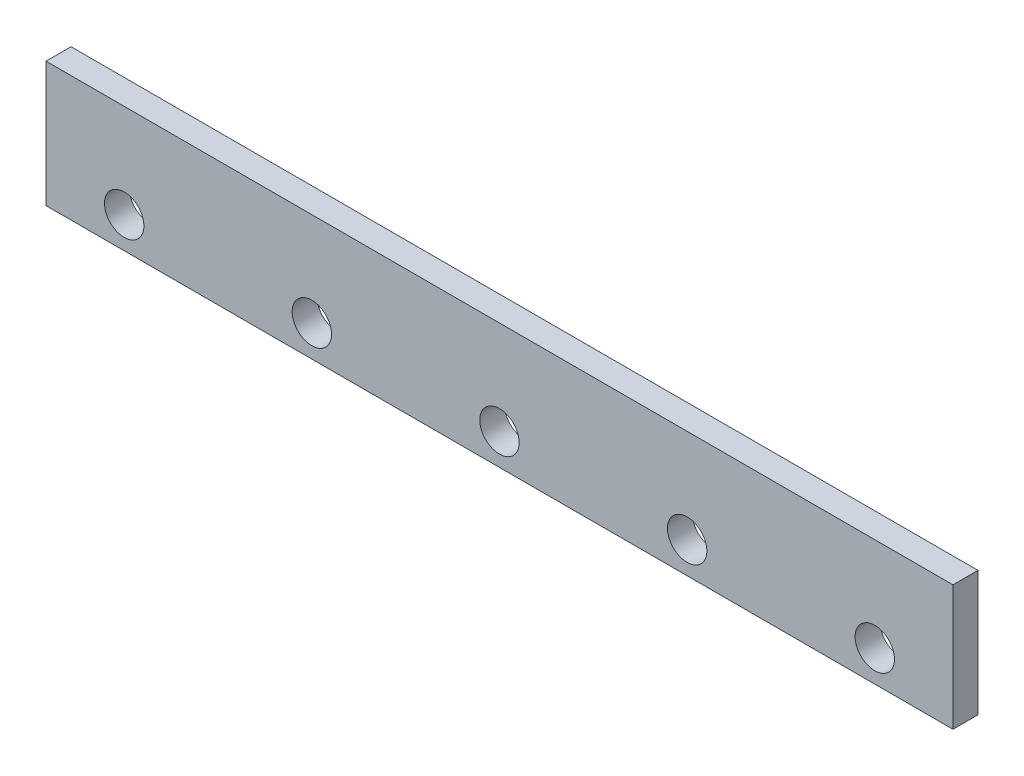
ISO-10303-21;
HEADER;
FILE_DESCRIPTION(('STEP AP214'),'2;1');
FILE_NAME('part.step','',(''),(''),'','','');
FILE_SCHEMA(('AUTOMOTIVE_DESIGN { 1 0 10303 214 1 1 1 1 }'));
ENDSEC;
DATA;
#1=APPLICATION_CONTEXT('core data for automotive mechanical design processes');
#2=APPLICATION_PROTOCOL_DEFINITION('international standard','automotive_design',2000,#1);
#3=PRODUCT_CONTEXT('',#1,'mechanical');
#4=PRODUCT('Part','Part','',(#3));
#5=PRODUCT_RELATED_PRODUCT_CATEGORY('part','',(#4));
#6=PRODUCT_DEFINITION_FORMATION('','',#4);
#7=PRODUCT_DEFINITION_CONTEXT('part definition',#1,'design');
#8=PRODUCT_DEFINITION('design','',#6,#7);
#9=PRODUCT_DEFINITION_SHAPE('','',#8);
#10=(LENGTH_UNIT() NAMED_UNIT(*) SI_UNIT(.MILLI.,.METRE.));
#11=(NAMED_UNIT(*) PLANE_ANGLE_UNIT() SI_UNIT($,.RADIAN.));
#12=(NAMED_UNIT(*) SI_UNIT($,.STERADIAN.) SOLID_ANGLE_UNIT());
#13=UNCERTAINTY_MEASURE_WITH_UNIT(LENGTH_MEASURE(1.E-05),#10,'distance_accuracy_value','');
#14=(GEOMETRIC_REPRESENTATION_CONTEXT(3) GLOBAL_UNCERTAINTY_ASSIGNED_CONTEXT((#13)) GLOBAL_UNIT_ASSIGNED_CONTEXT((#10,
#11,#12)) REPRESENTATION_CONTEXT('',''));
#15=CARTESIAN_POINT('',(0.,0.,0.));
#16=DIRECTION('',(0.,0.,1.));
#17=DIRECTION('',(1.,0.,0.));
#18=AXIS2_PLACEMENT_3D('',#15,#16,#17);
#19=CARTESIAN_POINT('',(0.,0.,16.));
#20=DIRECTION('',(1.,0.,0.));
#21=DIRECTION('',(0.,0.,-1.));
#22=AXIS2_PLACEMENT_3D('',#19,#20,#21);
#23=PLANE('',#22);
#24=DIRECTION('',(0.,-1.,0.));
#25=VECTOR('',#24,1.);
#26=CARTESIAN_POINT('',(0.,0.,0.));
#27=LINE('',#26,#25);
#28=CARTESIAN_POINT('',(0.,80.,0.));
#29=VERTEX_POINT('',#28);
#30=CARTESIAN_POINT('',(0.,0.,0.));
#31=VERTEX_POINT('',#30);
#32=EDGE_CURVE('E98',#29,#31,#27,.T.);
#33=ORIENTED_EDGE('',*,*,#32,.T.);
#34=DIRECTION('',(0.,0.,-1.));
#35=VECTOR('',#34,1.);
#36=CARTESIAN_POINT('',(0.,0.,16.));
#37=LINE('',#36,#35);
#38=CARTESIAN_POINT('',(0.,0.,16.));
#39=VERTEX_POINT('',#38);
#40=EDGE_CURVE('E11',#39,#31,#37,.T.);
#41=ORIENTED_EDGE('',*,*,#40,.F.);
#42=DIRECTION('',(0.,-1.,0.));
#43=VECTOR('',#42,1.);
#44=CARTESIAN_POINT('',(0.,0.,16.));
#45=LINE('',#44,#43);
#46=CARTESIAN_POINT('',(0.,80.,16.));
#47=VERTEX_POINT('',#46);
#48=EDGE_CURVE('E86',#47,#39,#45,.T.);
#49=ORIENTED_EDGE('',*,*,#48,.F.);
#50=DIRECTION('',(0.,0.,-1.));
#51=VECTOR('',#50,1.);
#52=CARTESIAN_POINT('',(0.,80.,16.));
#53=LINE('',#52,#51);
#54=EDGE_CURVE('E94',#47,#29,#53,.T.);
#55=ORIENTED_EDGE('',*,*,#54,.T.);
#56=EDGE_LOOP('',(#33,#41,#49,#55));
#57=FACE_BOUND('',#56,.T.);
#58=ADVANCED_FACE('F35',(#57),#23,.F.);
#59=CARTESIAN_POINT('',(0.,0.,16.));
#60=DIRECTION('',(0.,1.,0.));
#61=DIRECTION('',(0.,0.,1.));
#62=AXIS2_PLACEMENT_3D('',#59,#60,#61);
#63=PLANE('',#62);
#64=DIRECTION('',(1.,0.,0.));
#65=VECTOR('',#64,1.);
#66=CARTESIAN_POINT('',(0.,0.,0.));
#67=LINE('',#66,#65);
#68=CARTESIAN_POINT('',(580.,0.,0.));
#69=VERTEX_POINT('',#68);
#70=EDGE_CURVE('E90',#31,#69,#67,.T.);
#71=ORIENTED_EDGE('',*,*,#70,.T.);
#72=DIRECTION('',(0.,0.,-1.));
#73=VECTOR('',#72,1.);
#74=CARTESIAN_POINT('',(580.,0.,16.));
#75=LINE('',#74,#73);
#76=CARTESIAN_POINT('',(580.,0.,16.));
#77=VERTEX_POINT('',#76);
#78=EDGE_CURVE('E43',#77,#69,#75,.T.);
#79=ORIENTED_EDGE('',*,*,#78,.F.);
#80=DIRECTION('',(1.,0.,0.));
#81=VECTOR('',#80,1.);
#82=CARTESIAN_POINT('',(0.,0.,16.));
#83=LINE('',#82,#81);
#84=EDGE_CURVE('E81',#39,#77,#83,.T.);
#85=ORIENTED_EDGE('',*,*,#84,.F.);
#86=ORIENTED_EDGE('',*,*,#40,.T.);
#87=EDGE_LOOP('',(#71,#79,#85,#86));
#88=FACE_BOUND('',#87,.T.);
#89=ADVANCED_FACE('F89',(#88),#63,.F.);
#90=CARTESIAN_POINT('',(580.,0.,16.));
#91=DIRECTION('',(-1.,0.,0.));
#92=DIRECTION('',(0.,0.,1.));
#93=AXIS2_PLACEMENT_3D('',#90,#91,#92);
#94=PLANE('',#93);
#95=DIRECTION('',(0.,1.,0.));
#96=VECTOR('',#95,1.);
#97=CARTESIAN_POINT('',(580.,0.,0.));
#98=LINE('',#97,#96);
#99=CARTESIAN_POINT('',(580.,80.,0.));
#100=VERTEX_POINT('',#99);
#101=EDGE_CURVE('E68',#69,#100,#98,.T.);
#102=ORIENTED_EDGE('',*,*,#101,.T.);
#103=DIRECTION('',(0.,0.,-1.));
#104=VECTOR('',#103,1.);
#105=CARTESIAN_POINT('',(580.,80.,16.));
#106=LINE('',#105,#104);
#107=CARTESIAN_POINT('',(580.,80.,16.));
#108=VERTEX_POINT('',#107);
#109=EDGE_CURVE('E91',#108,#100,#106,.T.);
#110=ORIENTED_EDGE('',*,*,#109,.F.);
#111=DIRECTION('',(0.,1.,0.));
#112=VECTOR('',#111,1.);
#113=CARTESIAN_POINT('',(580.,0.,16.));
#114=LINE('',#113,#112);
#115=EDGE_CURVE('E84',#77,#108,#114,.T.);
#116=ORIENTED_EDGE('',*,*,#115,.F.);
#117=ORIENTED_EDGE('',*,*,#78,.T.);
#118=EDGE_LOOP('',(#102,#110,#116,#117));
#119=FACE_BOUND('',#118,.T.);
#120=ADVANCED_FACE('F92',(#119),#94,.F.);
#121=CARTESIAN_POINT('',(0.,80.,16.));
#122=DIRECTION('',(0.,-1.,0.));
#123=DIRECTION('',(0.,0.,-1.));
#124=AXIS2_PLACEMENT_3D('',#121,#122,#123);
#125=PLANE('',#124);
#126=DIRECTION('',(-1.,0.,0.));
#127=VECTOR('',#126,1.);
#128=CARTESIAN_POINT('',(0.,80.,0.));
#129=LINE('',#128,#127);
#130=EDGE_CURVE('E74',#100,#29,#129,.T.);
#131=ORIENTED_EDGE('',*,*,#130,.T.);
#132=ORIENTED_EDGE('',*,*,#54,.F.);
#133=DIRECTION('',(-1.,0.,0.));
#134=VECTOR('',#133,1.);
#135=CARTESIAN_POINT('',(0.,80.,16.));
#136=LINE('',#135,#134);
#137=EDGE_CURVE('E51',#108,#47,#136,.T.);
#138=ORIENTED_EDGE('',*,*,#137,.F.);
#139=ORIENTED_EDGE('',*,*,#109,.T.);
#140=EDGE_LOOP('',(#131,#132,#138,#139));
#141=FACE_BOUND('',#140,.T.);
#142=ADVANCED_FACE('F106',(#141),#125,.F.);
#143=CARTESIAN_POINT('',(0.,0.,16.));
#144=DIRECTION('',(0.,0.,-1.));
#145=DIRECTION('',(-1.,0.,0.));
#146=AXIS2_PLACEMENT_3D('',#143,#144,#145);
#147=PLANE('',#146);
#148=CARTESIAN_POINT('',(530.,20.,16.));
#149=DIRECTION('',(0.,0.,1.));
#150=DIRECTION('',(1.,0.,0.));
#151=AXIS2_PLACEMENT_3D('',#148,#149,#150);
#152=CIRCLE('',#151,12.5999999999999);
#153=CARTESIAN_POINT('',(542.6,20.,16.));
#154=VERTEX_POINT('',#153);
#155=EDGE_CURVE('E136',#154,#154,#152,.T.);
#156=ORIENTED_EDGE('',*,*,#155,.F.);
#157=EDGE_LOOP('',(#156));
#158=FACE_BOUND('',#157,.T.);
#159=CARTESIAN_POINT('',(410.,20.,16.));
#160=DIRECTION('',(0.,0.,1.));
#161=DIRECTION('',(1.,0.,0.));
#162=AXIS2_PLACEMENT_3D('',#159,#160,#161);
#163=CIRCLE('',#162,12.6);
#164=CARTESIAN_POINT('',(422.6,20.,16.));
#165=VERTEX_POINT('',#164);
#166=EDGE_CURVE('E130',#165,#165,#163,.T.);
#167=ORIENTED_EDGE('',*,*,#166,.F.);
#168=EDGE_LOOP('',(#167));
#169=FACE_BOUND('',#168,.T.);
#170=CARTESIAN_POINT('',(290.,20.,16.));
#171=DIRECTION('',(0.,0.,1.));
#172=DIRECTION('',(1.,0.,0.));
#173=AXIS2_PLACEMENT_3D('',#170,#171,#172);
#174=CIRCLE('',#173,12.6);
#175=CARTESIAN_POINT('',(302.6,20.,16.));
#176=VERTEX_POINT('',#175);
#177=EDGE_CURVE('E124',#176,#176,#174,.T.);
#178=ORIENTED_EDGE('',*,*,#177,.F.);
#179=EDGE_LOOP('',(#178));
#180=FACE_BOUND('',#179,.T.);
#181=CARTESIAN_POINT('',(170.,20.,16.));
#182=DIRECTION('',(0.,0.,1.));
#183=DIRECTION('',(1.,0.,0.));
#184=AXIS2_PLACEMENT_3D('',#181,#182,#183);
#185=CIRCLE('',#184,12.6);
#186=CARTESIAN_POINT('',(182.6,20.,16.));
#187=VERTEX_POINT('',#186);
#188=EDGE_CURVE('E118',#187,#187,#185,.T.);
#189=ORIENTED_EDGE('',*,*,#188,.F.);
#190=EDGE_LOOP('',(#189));
#191=FACE_BOUND('',#190,.T.);
#192=CARTESIAN_POINT('',(50.,20.,16.));
#193=DIRECTION('',(0.,0.,1.));
#194=DIRECTION('',(1.,0.,0.));
#195=AXIS2_PLACEMENT_3D('',#192,#193,#194);
#196=CIRCLE('',#195,12.6);
#197=CARTESIAN_POINT('',(62.6,20.,16.));
#198=VERTEX_POINT('',#197);
#199=EDGE_CURVE('E112',#198,#198,#196,.T.);
#200=ORIENTED_EDGE('',*,*,#199,.F.);
#201=EDGE_LOOP('',(#200));
#202=FACE_BOUND('',#201,.T.);
#203=ORIENTED_EDGE('',*,*,#48,.T.);
#204=ORIENTED_EDGE('',*,*,#84,.T.);
#205=ORIENTED_EDGE('',*,*,#115,.T.);
#206=ORIENTED_EDGE('',*,*,#137,.T.);
#207=EDGE_LOOP('',(#203,#204,#205,#206));
#208=FACE_BOUND('',#207,.T.);
#209=ADVANCED_FACE('F82',(#158,#169,#180,#191,#202,#208),#147,.F.);
#210=CARTESIAN_POINT('',(0.,0.,0.));
#211=DIRECTION('',(0.,0.,-1.));
#212=DIRECTION('',(-1.,0.,0.));
#213=AXIS2_PLACEMENT_3D('',#210,#211,#212);
#214=PLANE('',#213);
#215=CARTESIAN_POINT('',(530.,20.,0.));
#216=DIRECTION('',(0.,0.,1.));
#217=DIRECTION('',(1.,0.,0.));
#218=AXIS2_PLACEMENT_3D('',#215,#216,#217);
#219=CIRCLE('',#218,12.5999999999999);
#220=CARTESIAN_POINT('',(542.6,20.,0.));
#221=VERTEX_POINT('',#220);
#222=EDGE_CURVE('E133',#221,#221,#219,.T.);
#223=ORIENTED_EDGE('',*,*,#222,.T.);
#224=EDGE_LOOP('',(#223));
#225=FACE_BOUND('',#224,.T.);
#226=CARTESIAN_POINT('',(410.,20.,0.));
#227=DIRECTION('',(0.,0.,1.));
#228=DIRECTION('',(1.,0.,0.));
#229=AXIS2_PLACEMENT_3D('',#226,#227,#228);
#230=CIRCLE('',#229,12.6);
#231=CARTESIAN_POINT('',(422.6,20.,0.));
#232=VERTEX_POINT('',#231);
#233=EDGE_CURVE('E127',#232,#232,#230,.T.);
#234=ORIENTED_EDGE('',*,*,#233,.T.);
#235=EDGE_LOOP('',(#234));
#236=FACE_BOUND('',#235,.T.);
#237=CARTESIAN_POINT('',(290.,20.,0.));
#238=DIRECTION('',(0.,0.,1.));
#239=DIRECTION('',(1.,0.,0.));
#240=AXIS2_PLACEMENT_3D('',#237,#238,#239);
#241=CIRCLE('',#240,12.6);
#242=CARTESIAN_POINT('',(302.6,20.,0.));
#243=VERTEX_POINT('',#242);
#244=EDGE_CURVE('E121',#243,#243,#241,.T.);
#245=ORIENTED_EDGE('',*,*,#244,.T.);
#246=EDGE_LOOP('',(#245));
#247=FACE_BOUND('',#246,.T.);
#248=CARTESIAN_POINT('',(170.,20.,0.));
#249=DIRECTION('',(0.,0.,1.));
#250=DIRECTION('',(1.,0.,0.));
#251=AXIS2_PLACEMENT_3D('',#248,#249,#250);
#252=CIRCLE('',#251,12.6);
#253=CARTESIAN_POINT('',(182.6,20.,0.));
#254=VERTEX_POINT('',#253);
#255=EDGE_CURVE('E115',#254,#254,#252,.T.);
#256=ORIENTED_EDGE('',*,*,#255,.T.);
#257=EDGE_LOOP('',(#256));
#258=FACE_BOUND('',#257,.T.);
#259=CARTESIAN_POINT('',(50.,20.,0.));
#260=DIRECTION('',(0.,0.,1.));
#261=DIRECTION('',(1.,0.,0.));
#262=AXIS2_PLACEMENT_3D('',#259,#260,#261);
#263=CIRCLE('',#262,12.6);
#264=CARTESIAN_POINT('',(62.6,20.,0.));
#265=VERTEX_POINT('',#264);
#266=EDGE_CURVE('E101',#265,#265,#263,.T.);
#267=ORIENTED_EDGE('',*,*,#266,.T.);
#268=EDGE_LOOP('',(#267));
#269=FACE_BOUND('',#268,.T.);
#270=ORIENTED_EDGE('',*,*,#32,.F.);
#271=ORIENTED_EDGE('',*,*,#130,.F.);
#272=ORIENTED_EDGE('',*,*,#101,.F.);
#273=ORIENTED_EDGE('',*,*,#70,.F.);
#274=EDGE_LOOP('',(#270,#271,#272,#273));
#275=FACE_BOUND('',#274,.T.);
#276=ADVANCED_FACE('F109',(#225,#236,#247,#258,#269,#275),#214,.T.);
#277=CARTESIAN_POINT('',(50.,20.,0.));
#278=DIRECTION('',(0.,0.,1.));
#279=DIRECTION('',(1.,0.,0.));
#280=AXIS2_PLACEMENT_3D('',#277,#278,#279);
#281=CYLINDRICAL_SURFACE('',#280,12.6);
#282=ORIENTED_EDGE('',*,*,#266,.F.);
#283=EDGE_LOOP('',(#282));
#284=FACE_BOUND('',#283,.T.);
#285=ORIENTED_EDGE('',*,*,#199,.T.);
#286=EDGE_LOOP('',(#285));
#287=FACE_BOUND('',#286,.T.);
#288=ADVANCED_FACE('F162',(#284,#287),#281,.F.);
#289=CARTESIAN_POINT('',(170.,20.,0.));
#290=DIRECTION('',(0.,0.,1.));
#291=DIRECTION('',(1.,0.,0.));
#292=AXIS2_PLACEMENT_3D('',#289,#290,#291);
#293=CYLINDRICAL_SURFACE('',#292,12.6);
#294=ORIENTED_EDGE('',*,*,#255,.F.);
#295=EDGE_LOOP('',(#294));
#296=FACE_BOUND('',#295,.T.);
#297=ORIENTED_EDGE('',*,*,#188,.T.);
#298=EDGE_LOOP('',(#297));
#299=FACE_BOUND('',#298,.T.);
#300=ADVANCED_FACE('F164',(#296,#299),#293,.F.);
#301=CARTESIAN_POINT('',(290.,20.,0.));
#302=DIRECTION('',(0.,0.,1.));
#303=DIRECTION('',(1.,0.,0.));
#304=AXIS2_PLACEMENT_3D('',#301,#302,#303);
#305=CYLINDRICAL_SURFACE('',#304,12.6);
#306=ORIENTED_EDGE('',*,*,#244,.F.);
#307=EDGE_LOOP('',(#306));
#308=FACE_BOUND('',#307,.T.);
#309=ORIENTED_EDGE('',*,*,#177,.T.);
#310=EDGE_LOOP('',(#309));
#311=FACE_BOUND('',#310,.T.);
#312=ADVANCED_FACE('F171',(#308,#311),#305,.F.);
#313=CARTESIAN_POINT('',(410.,20.,0.));
#314=DIRECTION('',(0.,0.,1.));
#315=DIRECTION('',(1.,0.,0.));
#316=AXIS2_PLACEMENT_3D('',#313,#314,#315);
#317=CYLINDRICAL_SURFACE('',#316,12.6);
#318=ORIENTED_EDGE('',*,*,#233,.F.);
#319=EDGE_LOOP('',(#318));
#320=FACE_BOUND('',#319,.T.);
#321=ORIENTED_EDGE('',*,*,#166,.T.);
#322=EDGE_LOOP('',(#321));
#323=FACE_BOUND('',#322,.T.);
#324=ADVANCED_FACE('F147',(#320,#323),#317,.F.);
#325=CARTESIAN_POINT('',(530.,20.,0.));
#326=DIRECTION('',(0.,0.,1.));
#327=DIRECTION('',(1.,0.,0.));
#328=AXIS2_PLACEMENT_3D('',#325,#326,#327);
#329=CYLINDRICAL_SURFACE('',#328,12.5999999999999);
#330=ORIENTED_EDGE('',*,*,#222,.F.);
#331=EDGE_LOOP('',(#330));
#332=FACE_BOUND('',#331,.T.);
#333=ORIENTED_EDGE('',*,*,#155,.T.);
#334=EDGE_LOOP('',(#333));
#335=FACE_BOUND('',#334,.T.);
#336=ADVANCED_FACE('F144',(#332,#335),#329,.F.);
#337=CLOSED_SHELL('',(#58,#89,#120,#142,#209,#276,#288,#300,#312,#324,#336));
#338=MANIFOLD_SOLID_BREP('B2',#337);
#339=ADVANCED_BREP_SHAPE_REPRESENTATION('',(#18,#338),#14);
#340=SHAPE_DEFINITION_REPRESENTATION(#9,#339);
ENDSEC;
END-ISO-10303-21;
